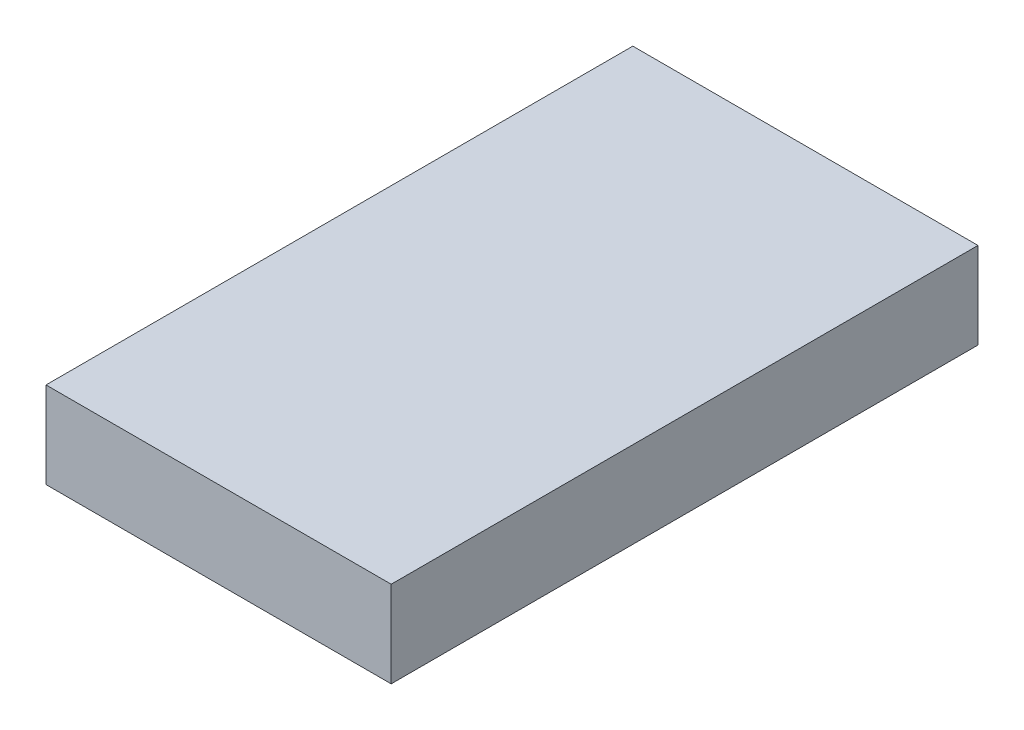
ISO-10303-21;
HEADER;
FILE_DESCRIPTION(('STEP AP214'),'2;1');
FILE_NAME('part.step','',(''),(''),'','','');
FILE_SCHEMA(('AUTOMOTIVE_DESIGN { 1 0 10303 214 1 1 1 1 }'));
ENDSEC;
DATA;
#1=APPLICATION_CONTEXT('core data for automotive mechanical design processes');
#2=APPLICATION_PROTOCOL_DEFINITION('international standard','automotive_design',2000,#1);
#3=PRODUCT_CONTEXT('',#1,'mechanical');
#4=PRODUCT('Part','Part','',(#3));
#5=PRODUCT_RELATED_PRODUCT_CATEGORY('part','',(#4));
#6=PRODUCT_DEFINITION_FORMATION('','',#4);
#7=PRODUCT_DEFINITION_CONTEXT('part definition',#1,'design');
#8=PRODUCT_DEFINITION('design','',#6,#7);
#9=PRODUCT_DEFINITION_SHAPE('','',#8);
#10=(LENGTH_UNIT() NAMED_UNIT(*) SI_UNIT(.MILLI.,.METRE.));
#11=(NAMED_UNIT(*) PLANE_ANGLE_UNIT() SI_UNIT($,.RADIAN.));
#12=(NAMED_UNIT(*) SI_UNIT($,.STERADIAN.) SOLID_ANGLE_UNIT());
#13=UNCERTAINTY_MEASURE_WITH_UNIT(LENGTH_MEASURE(1.E-05),#10,'distance_accuracy_value','');
#14=(GEOMETRIC_REPRESENTATION_CONTEXT(3) GLOBAL_UNCERTAINTY_ASSIGNED_CONTEXT((#13)) GLOBAL_UNIT_ASSIGNED_CONTEXT((#10,
#11,#12)) REPRESENTATION_CONTEXT('',''));
#15=CARTESIAN_POINT('',(0.,0.,0.));
#16=DIRECTION('',(0.,0.,1.));
#17=DIRECTION('',(1.,0.,0.));
#18=AXIS2_PLACEMENT_3D('',#15,#16,#17);
#19=CARTESIAN_POINT('',(60.,30.,102.));
#20=DIRECTION('',(-1.,0.,0.));
#21=DIRECTION('',(0.,0.,1.));
#22=AXIS2_PLACEMENT_3D('',#19,#20,#21);
#23=PLANE('',#22);
#24=DIRECTION('',(0.,0.,-1.));
#25=VECTOR('',#24,1.);
#26=CARTESIAN_POINT('',(60.,0.,102.));
#27=LINE('',#26,#25);
#28=CARTESIAN_POINT('',(60.,0.,102.));
#29=VERTEX_POINT('',#28);
#30=CARTESIAN_POINT('',(60.,0.,-102.));
#31=VERTEX_POINT('',#30);
#32=EDGE_CURVE('E107',#29,#31,#27,.T.);
#33=ORIENTED_EDGE('',*,*,#32,.T.);
#34=DIRECTION('',(0.,-1.,0.));
#35=VECTOR('',#34,1.);
#36=CARTESIAN_POINT('',(60.,30.,-102.));
#37=LINE('',#36,#35);
#38=CARTESIAN_POINT('',(60.,30.,-102.));
#39=VERTEX_POINT('',#38);
#40=EDGE_CURVE('E11',#39,#31,#37,.T.);
#41=ORIENTED_EDGE('',*,*,#40,.F.);
#42=DIRECTION('',(0.,0.,-1.));
#43=VECTOR('',#42,1.);
#44=CARTESIAN_POINT('',(60.,30.,102.));
#45=LINE('',#44,#43);
#46=CARTESIAN_POINT('',(60.,30.,102.));
#47=VERTEX_POINT('',#46);
#48=EDGE_CURVE('E91',#47,#39,#45,.T.);
#49=ORIENTED_EDGE('',*,*,#48,.F.);
#50=DIRECTION('',(0.,-1.,0.));
#51=VECTOR('',#50,1.);
#52=CARTESIAN_POINT('',(60.,30.,102.));
#53=LINE('',#52,#51);
#54=EDGE_CURVE('E103',#47,#29,#53,.T.);
#55=ORIENTED_EDGE('',*,*,#54,.T.);
#56=EDGE_LOOP('',(#33,#41,#49,#55));
#57=FACE_BOUND('',#56,.T.);
#58=ADVANCED_FACE('F39',(#57),#23,.F.);
#59=CARTESIAN_POINT('',(-60.,30.,-102.));
#60=DIRECTION('',(0.,0.,1.));
#61=DIRECTION('',(1.,0.,0.));
#62=AXIS2_PLACEMENT_3D('',#59,#60,#61);
#63=PLANE('',#62);
#64=DIRECTION('',(-1.,0.,0.));
#65=VECTOR('',#64,1.);
#66=CARTESIAN_POINT('',(-60.,0.,-102.));
#67=LINE('',#66,#65);
#68=CARTESIAN_POINT('',(-60.,0.,-102.));
#69=VERTEX_POINT('',#68);
#70=EDGE_CURVE('E96',#31,#69,#67,.T.);
#71=ORIENTED_EDGE('',*,*,#70,.T.);
#72=DIRECTION('',(0.,-1.,0.));
#73=VECTOR('',#72,1.);
#74=CARTESIAN_POINT('',(-60.,30.,-102.));
#75=LINE('',#74,#73);
#76=CARTESIAN_POINT('',(-60.,30.,-102.));
#77=VERTEX_POINT('',#76);
#78=EDGE_CURVE('E48',#77,#69,#75,.T.);
#79=ORIENTED_EDGE('',*,*,#78,.F.);
#80=DIRECTION('',(-1.,0.,0.));
#81=VECTOR('',#80,1.);
#82=CARTESIAN_POINT('',(-60.,30.,-102.));
#83=LINE('',#82,#81);
#84=EDGE_CURVE('E86',#39,#77,#83,.T.);
#85=ORIENTED_EDGE('',*,*,#84,.F.);
#86=ORIENTED_EDGE('',*,*,#40,.T.);
#87=EDGE_LOOP('',(#71,#79,#85,#86));
#88=FACE_BOUND('',#87,.T.);
#89=ADVANCED_FACE('F95',(#88),#63,.F.);
#90=CARTESIAN_POINT('',(-60.,30.,102.));
#91=DIRECTION('',(1.,0.,0.));
#92=DIRECTION('',(0.,0.,-1.));
#93=AXIS2_PLACEMENT_3D('',#90,#91,#92);
#94=PLANE('',#93);
#95=DIRECTION('',(0.,0.,1.));
#96=VECTOR('',#95,1.);
#97=CARTESIAN_POINT('',(-60.,0.,102.));
#98=LINE('',#97,#96);
#99=CARTESIAN_POINT('',(-60.,0.,102.));
#100=VERTEX_POINT('',#99);
#101=EDGE_CURVE('E73',#69,#100,#98,.T.);
#102=ORIENTED_EDGE('',*,*,#101,.T.);
#103=DIRECTION('',(0.,-1.,0.));
#104=VECTOR('',#103,1.);
#105=CARTESIAN_POINT('',(-60.,30.,102.));
#106=LINE('',#105,#104);
#107=CARTESIAN_POINT('',(-60.,30.,102.));
#108=VERTEX_POINT('',#107);
#109=EDGE_CURVE('E98',#108,#100,#106,.T.);
#110=ORIENTED_EDGE('',*,*,#109,.F.);
#111=DIRECTION('',(0.,0.,1.));
#112=VECTOR('',#111,1.);
#113=CARTESIAN_POINT('',(-60.,30.,102.));
#114=LINE('',#113,#112);
#115=EDGE_CURVE('E89',#77,#108,#114,.T.);
#116=ORIENTED_EDGE('',*,*,#115,.F.);
#117=ORIENTED_EDGE('',*,*,#78,.T.);
#118=EDGE_LOOP('',(#102,#110,#116,#117));
#119=FACE_BOUND('',#118,.T.);
#120=ADVANCED_FACE('F99',(#119),#94,.F.);
#121=CARTESIAN_POINT('',(-60.,30.,102.));
#122=DIRECTION('',(0.,0.,-1.));
#123=DIRECTION('',(-1.,0.,0.));
#124=AXIS2_PLACEMENT_3D('',#121,#122,#123);
#125=PLANE('',#124);
#126=DIRECTION('',(1.,0.,0.));
#127=VECTOR('',#126,1.);
#128=CARTESIAN_POINT('',(-60.,0.,102.));
#129=LINE('',#128,#127);
#130=EDGE_CURVE('E79',#100,#29,#129,.T.);
#131=ORIENTED_EDGE('',*,*,#130,.T.);
#132=ORIENTED_EDGE('',*,*,#54,.F.);
#133=DIRECTION('',(1.,0.,0.));
#134=VECTOR('',#133,1.);
#135=CARTESIAN_POINT('',(-60.,30.,102.));
#136=LINE('',#135,#134);
#137=EDGE_CURVE('E56',#108,#47,#136,.T.);
#138=ORIENTED_EDGE('',*,*,#137,.F.);
#139=ORIENTED_EDGE('',*,*,#109,.T.);
#140=EDGE_LOOP('',(#131,#132,#138,#139));
#141=FACE_BOUND('',#140,.T.);
#142=ADVANCED_FACE('F120',(#141),#125,.F.);
#143=CARTESIAN_POINT('',(0.,30.,0.));
#144=DIRECTION('',(0.,-1.,0.));
#145=DIRECTION('',(0.,0.,-1.));
#146=AXIS2_PLACEMENT_3D('',#143,#144,#145);
#147=PLANE('',#146);
#148=ORIENTED_EDGE('',*,*,#48,.T.);
#149=ORIENTED_EDGE('',*,*,#84,.T.);
#150=ORIENTED_EDGE('',*,*,#115,.T.);
#151=ORIENTED_EDGE('',*,*,#137,.T.);
#152=EDGE_LOOP('',(#148,#149,#150,#151));
#153=FACE_BOUND('',#152,.T.);
#154=ADVANCED_FACE('F87',(#153),#147,.F.);
#155=CARTESIAN_POINT('',(0.,0.,0.));
#156=DIRECTION('',(0.,-1.,0.));
#157=DIRECTION('',(0.,0.,-1.));
#158=AXIS2_PLACEMENT_3D('',#155,#156,#157);
#159=PLANE('',#158);
#160=ORIENTED_EDGE('',*,*,#32,.F.);
#161=ORIENTED_EDGE('',*,*,#130,.F.);
#162=ORIENTED_EDGE('',*,*,#101,.F.);
#163=ORIENTED_EDGE('',*,*,#70,.F.);
#164=EDGE_LOOP('',(#160,#161,#162,#163));
#165=FACE_BOUND('',#164,.T.);
#166=ADVANCED_FACE('F123',(#165),#159,.T.);
#167=CLOSED_SHELL('',(#58,#89,#120,#142,#154,#166));
#168=MANIFOLD_SOLID_BREP('B2',#167);
#169=ADVANCED_BREP_SHAPE_REPRESENTATION('',(#18,#168),#14);
#170=SHAPE_DEFINITION_REPRESENTATION(#9,#169);
ENDSEC;
END-ISO-10303-21;
